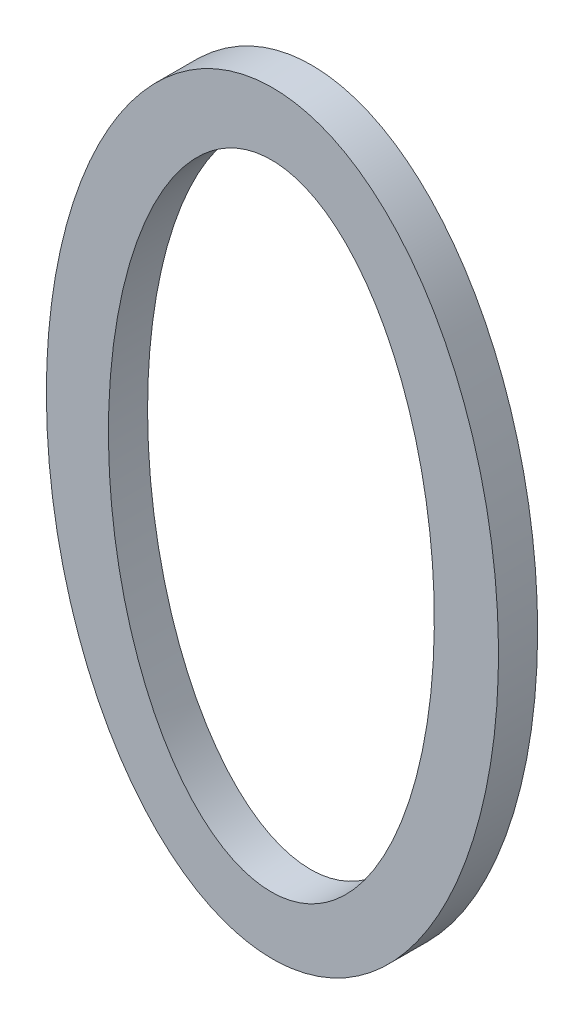
ISO-10303-21;
HEADER;
FILE_DESCRIPTION(('STEP AP214'),'2;1');
FILE_NAME('part.step','',(''),(''),'','','');
FILE_SCHEMA(('AUTOMOTIVE_DESIGN { 1 0 10303 214 1 1 1 1 }'));
ENDSEC;
DATA;
#1=APPLICATION_CONTEXT('core data for automotive mechanical design processes');
#2=APPLICATION_PROTOCOL_DEFINITION('international standard','automotive_design',2000,#1);
#3=PRODUCT_CONTEXT('',#1,'mechanical');
#4=PRODUCT('Part','Part','',(#3));
#5=PRODUCT_RELATED_PRODUCT_CATEGORY('part','',(#4));
#6=PRODUCT_DEFINITION_FORMATION('','',#4);
#7=PRODUCT_DEFINITION_CONTEXT('part definition',#1,'design');
#8=PRODUCT_DEFINITION('design','',#6,#7);
#9=PRODUCT_DEFINITION_SHAPE('','',#8);
#10=(LENGTH_UNIT() NAMED_UNIT(*) SI_UNIT(.MILLI.,.METRE.));
#11=(NAMED_UNIT(*) PLANE_ANGLE_UNIT() SI_UNIT($,.RADIAN.));
#12=(NAMED_UNIT(*) SI_UNIT($,.STERADIAN.) SOLID_ANGLE_UNIT());
#13=UNCERTAINTY_MEASURE_WITH_UNIT(LENGTH_MEASURE(1.E-05),#10,'distance_accuracy_value','');
#14=(GEOMETRIC_REPRESENTATION_CONTEXT(3) GLOBAL_UNCERTAINTY_ASSIGNED_CONTEXT((#13)) GLOBAL_UNIT_ASSIGNED_CONTEXT((#10,
#11,#12)) REPRESENTATION_CONTEXT('',''));
#15=CARTESIAN_POINT('',(0.,0.,0.));
#16=DIRECTION('',(0.,0.,1.));
#17=DIRECTION('',(1.,0.,0.));
#18=AXIS2_PLACEMENT_3D('',#15,#16,#17);
#19=CARTESIAN_POINT('',(-0.239741070500927,-0.0928215205563488,-0.000499999999999999));
#20=CARTESIAN_POINT('',(-0.23557745361825,-0.0928215205563488,-0.000499999999999999));
#21=CARTESIAN_POINT('',(-0.23557745361825,-0.0847200926686513,-0.000499999999999999));
#22=CARTESIAN_POINT('',(-0.23557745361825,-0.0766186647809537,-0.000499999999999999));
#23=CARTESIAN_POINT('',(-0.239741070500927,-0.0766186647809537,-0.000499999999999999));
#24=CARTESIAN_POINT('',(-0.243904687383605,-0.0766186647809537,-0.000499999999999999));
#25=CARTESIAN_POINT('',(-0.243904687383605,-0.0847200926686513,-0.000499999999999999));
#26=CARTESIAN_POINT('',(-0.243904687383605,-0.0928215205563488,-0.000499999999999999));
#27=CARTESIAN_POINT('',(-0.239741070500927,-0.0928215205563488,-0.000499999999999999));
#28=CARTESIAN_POINT('',(-0.239741070500927,-0.0928215205563488,0.000499999999999999));
#29=CARTESIAN_POINT('',(-0.23557745361825,-0.0928215205563488,0.000499999999999999));
#30=CARTESIAN_POINT('',(-0.23557745361825,-0.0847200926686513,0.000499999999999999));
#31=CARTESIAN_POINT('',(-0.23557745361825,-0.0766186647809537,0.000499999999999999));
#32=CARTESIAN_POINT('',(-0.239741070500927,-0.0766186647809537,0.000499999999999999));
#33=CARTESIAN_POINT('',(-0.243904687383605,-0.0766186647809537,0.000499999999999999));
#34=CARTESIAN_POINT('',(-0.243904687383605,-0.0847200926686513,0.000499999999999999));
#35=CARTESIAN_POINT('',(-0.243904687383605,-0.0928215205563488,0.000499999999999999));
#36=CARTESIAN_POINT('',(-0.239741070500927,-0.0928215205563488,0.000499999999999999));
#37=(BOUNDED_SURFACE() B_SPLINE_SURFACE(1,2,((#19,#20,#21,#22,#23,#24,#25,#26,#27),(#28,#29,#30,
#31,#32,#33,#34,#35,#36)),.UNSPECIFIED.,.F.,.T.,.F.) B_SPLINE_SURFACE_WITH_KNOTS((2,2),(3,2,2,2,
3),(-0.123435030696077,0.),(-3.14159265358979,-1.5707963267949,0.,1.5707963267949,
3.14159265358979),.UNSPECIFIED.) GEOMETRIC_REPRESENTATION_ITEM() RATIONAL_B_SPLINE_SURFACE(((1.,
0.707106781186548,1.,0.707106781186548,1.,0.707106781186548,1.,0.707106781186548,1.),(1.,
0.707106781186548,1.,0.707106781186548,1.,0.707106781186548,1.,0.707106781186548,1.))) REPRESENTATION_ITEM('') SURFACE());
#38=CARTESIAN_POINT('',(-0.239741070500927,-0.0928215205563488,-0.000499999999999999));
#39=CARTESIAN_POINT('',(-0.243904687383605,-0.0928215205563488,-0.000499999999999999));
#40=CARTESIAN_POINT('',(-0.243904687383605,-0.0847200926686513,-0.000499999999999999));
#41=CARTESIAN_POINT('',(-0.243904687383605,-0.0766186647809537,-0.000499999999999999));
#42=CARTESIAN_POINT('',(-0.239741070500927,-0.0766186647809537,-0.000499999999999999));
#43=CARTESIAN_POINT('',(-0.23557745361825,-0.0766186647809537,-0.000499999999999999));
#44=CARTESIAN_POINT('',(-0.23557745361825,-0.0847200926686513,-0.000499999999999999));
#45=CARTESIAN_POINT('',(-0.23557745361825,-0.0928215205563488,-0.000499999999999999));
#46=CARTESIAN_POINT('',(-0.239741070500927,-0.0928215205563488,-0.000499999999999999));
#47=(BOUNDED_CURVE() B_SPLINE_CURVE(2,(#38,#39,#40,#41,#42,#43,#44,#45,#46),.UNSPECIFIED.,.T.,
.F.) B_SPLINE_CURVE_WITH_KNOTS((3,2,2,2,3),(-3.14159265358979,-1.5707963267949,0.,
1.5707963267949,3.14159265358979),
.UNSPECIFIED.) CURVE() GEOMETRIC_REPRESENTATION_ITEM() RATIONAL_B_SPLINE_CURVE((1.,
0.707106781186548,1.,0.707106781186548,1.,0.707106781186548,1.,0.707106781186548,1.)) REPRESENTATION_ITEM(''));
#48=CARTESIAN_POINT('',(-0.239741070500927,-0.0928215205563488,-0.000499999999999999));
#49=VERTEX_POINT('',#48);
#50=EDGE_CURVE('E11',#49,#49,#47,.F.);
#51=CARTESIAN_POINT('',(-0.239741070500927,-0.0928215205563488,-0.000499999999999999));
#52=CARTESIAN_POINT('',(-0.239741070500927,-0.0928215205563488,0.000499999999999999));
#53=B_SPLINE_CURVE_WITH_KNOTS('',1,(#51,#52),.UNSPECIFIED.,.F.,.F.,(2,2),(-0.123435030696077,
0.),.UNSPECIFIED.);
#54=CARTESIAN_POINT('',(-0.239741070500927,-0.0928215205563488,0.000499999999999999));
#55=VERTEX_POINT('',#54);
#56=EDGE_CURVE('E27',#49,#55,#53,.T.);
#57=CARTESIAN_POINT('',(-0.239741070500927,-0.0928215205563488,0.000499999999999999));
#58=CARTESIAN_POINT('',(-0.239710255624817,-0.0928215219779034,0.000499999999999999));
#59=CARTESIAN_POINT('',(-0.239679441054796,-0.0928208549871667,0.000499999999999999));
#60=CARTESIAN_POINT('',(-0.239617549606014,-0.0928181805777694,0.000499999999999999));
#61=CARTESIAN_POINT('',(-0.239586473324224,-0.0928161593186057,0.000499999999999999));
#62=CARTESIAN_POINT('',(-0.239524078410907,-0.0928107418398933,0.000499999999999999));
#63=CARTESIAN_POINT('',(-0.239492761139654,-0.0928073299708319,0.000499999999999999));
#64=CARTESIAN_POINT('',(-0.239429904919492,-0.0927991001030989,0.000499999999999999));
#65=CARTESIAN_POINT('',(-0.239398368253061,-0.0927942646901675,0.000499999999999999));
#66=CARTESIAN_POINT('',(-0.239335094974164,-0.0927831573493299,0.000499999999999999));
#67=CARTESIAN_POINT('',(-0.239303361722461,-0.092776866298359,0.000499999999999999));
#68=CARTESIAN_POINT('',(-0.239239717955471,-0.0927628189271733,0.000499999999999999));
#69=CARTESIAN_POINT('',(-0.23920781202009,-0.0927550418814285,0.000499999999999999));
#70=CARTESIAN_POINT('',(-0.23914384653551,-0.0927379953143086,0.000499999999999999));
#71=CARTESIAN_POINT('',(-0.239111792905908,-0.0927287036069431,0.000499999999999999));
#72=CARTESIAN_POINT('',(-0.239047556632652,-0.0927086022326721,0.000499999999999999));
#73=CARTESIAN_POINT('',(-0.239015381342398,-0.0926977690957382,0.000499999999999999));
#74=CARTESIAN_POINT('',(-0.238950927288394,-0.0926745612102115,0.000499999999999999));
#75=CARTESIAN_POINT('',(-0.238918657375391,-0.092662161910983,0.000499999999999999));
#76=CARTESIAN_POINT('',(-0.238854040542747,-0.092635800013457,0.000499999999999999));
#77=CARTESIAN_POINT('',(-0.238821704001541,-0.092621812007243,0.000499999999999999));
#78=CARTESIAN_POINT('',(-0.238756981287364,-0.0925922531050914,0.000499999999999999));
#79=CARTESIAN_POINT('',(-0.238724607016808,-0.0925766561791553,0.000499999999999999));
#80=CARTESIAN_POINT('',(-0.238659837102138,-0.0925438620806571,0.000499999999999999));
#81=CARTESIAN_POINT('',(-0.238627454847485,-0.0925266384952147,0.000499999999999999));
#82=CARTESIAN_POINT('',(-0.238562698073738,-0.0924905760932693,0.000499999999999999));
#83=CARTESIAN_POINT('',(-0.238530338363299,-0.0924717107168161,0.000499999999999999));
#84=CARTESIAN_POINT('',(-0.238465656596576,-0.09243235226001,0.000499999999999999));
#85=CARTESIAN_POINT('',(-0.238433350672856,-0.0924118326985725,0.000499999999999999));
#86=CARTESIAN_POINT('',(-0.238368807156111,-0.0923691560475774,0.000499999999999999));
#87=CARTESIAN_POINT('',(-0.238336586901167,-0.0923469727665091,0.000499999999999999));
#88=CARTESIAN_POINT('',(-0.238272246095173,-0.0923009616339073,0.000499999999999999));
#89=CARTESIAN_POINT('',(-0.23824014395103,-0.0922771080718518,0.000499999999999999));
#90=CARTESIAN_POINT('',(-0.238176071362256,-0.0922277522411537,0.000499999999999999));
#91=CARTESIAN_POINT('',(-0.238144120243262,-0.0922022249122562,0.000499999999999999));
#92=CARTESIAN_POINT('',(-0.238080382248081,-0.0921495204413501,0.000499999999999999));
#93=CARTESIAN_POINT('',(-0.238048615457796,-0.0921223190350897,0.000499999999999999));
#94=CARTESIAN_POINT('',(-0.237985279089599,-0.09206626841285,0.000499999999999999));
#95=CARTESIAN_POINT('',(-0.237953730194634,-0.092037395849571,0.000499999999999999));
#96=CARTESIAN_POINT('',(-0.237890863026434,-0.0919780082156455,0.000499999999999999));
#97=CARTESIAN_POINT('',(-0.237859565872452,-0.0919474708139435,0.000499999999999999));
#98=CARTESIAN_POINT('',(-0.237797235487511,-0.0918847618069917,0.000499999999999999));
#99=CARTESIAN_POINT('',(-0.237766223644756,-0.0918525689550075,0.000499999999999999));
#100=CARTESIAN_POINT('',(-0.237704498658365,-0.0917865618573618,0.000499999999999999));
#101=CARTESIAN_POINT('',(-0.237673807048328,-0.0917527275282628,0.000499999999999999));
#102=CARTESIAN_POINT('',(-0.237581251269773,-0.0916477056543155,0.000499999999999999));
#103=CARTESIAN_POINT('',(-0.237520987160101,-0.0915751001337143,0.000499999999999999));
#104=CARTESIAN_POINT('',(-0.237401975965692,-0.0914237060321999,0.000499999999999999));
#105=CARTESIAN_POINT('',(-0.237343397350655,-0.0913447858628405,0.000499999999999999));
#106=CARTESIAN_POINT('',(-0.237228015533471,-0.0911809645291218,0.000499999999999999));
#107=CARTESIAN_POINT('',(-0.237171373370647,-0.0910959502318112,0.000499999999999999));
#108=CARTESIAN_POINT('',(-0.237060121615343,-0.090920204657932,0.000499999999999999));
#109=CARTESIAN_POINT('',(-0.237005663081152,-0.0908293780877442,0.000499999999999999));
#110=CARTESIAN_POINT('',(-0.236899021302058,-0.0906423204665298,0.000499999999999999));
#111=CARTESIAN_POINT('',(-0.236846976929139,-0.0905460104774371,0.000499999999999999));
#112=CARTESIAN_POINT('',(-0.236745390377323,-0.0903483465773976,0.000499999999999999));
#113=CARTESIAN_POINT('',(-0.236695973426184,-0.0902469284925661,0.000499999999999999));
#114=CARTESIAN_POINT('',(-0.236599848562429,-0.0900394514248187,0.000499999999999999));
#115=CARTESIAN_POINT('',(-0.236553251310576,-0.0899333413104373,0.000499999999999999));
#116=CARTESIAN_POINT('',(-0.236462949818907,-0.0897169202861266,0.000499999999999999));
#117=CARTESIAN_POINT('',(-0.236419341226868,-0.0896065695693265,0.000499999999999999));
#118=CARTESIAN_POINT('',(-0.236335175678132,-0.089382138107317,0.000499999999999999));
#119=CARTESIAN_POINT('',(-0.236294699292596,-0.08926802722033,0.000499999999999999));
#120=CARTESIAN_POINT('',(-0.236216929573575,-0.0890365698632435,0.000499999999999999));
#121=CARTESIAN_POINT('',(-0.236179701975977,-0.088919201355896,0.000499999999999999));
#122=CARTESIAN_POINT('',(-0.236108533075528,-0.088681740090854,0.000499999999999999));
#123=CARTESIAN_POINT('',(-0.236074643155416,-0.0885616319706723,0.000499999999999999));
#124=CARTESIAN_POINT('',(-0.236010223317749,-0.0883192108050715,0.000499999999999999));
#125=CARTESIAN_POINT('',(-0.235979731081215,-0.088196887758484,0.000499999999999999));
#126=CARTESIAN_POINT('',(-0.235922153967183,-0.0879505629573102,0.000499999999999999));
#127=CARTESIAN_POINT('',(-0.23589509387889,-0.0878265554432664,0.000499999999999999));
#128=CARTESIAN_POINT('',(-0.23581898607276,-0.0874525072869222,0.000499999999999999));
#129=CARTESIAN_POINT('',(-0.23577525471483,-0.0872013681411857,0.000499999999999999));
#130=CARTESIAN_POINT('',(-0.235701278327137,-0.0866984299777538,0.000499999999999999));
#131=CARTESIAN_POINT('',(-0.235670966782733,-0.0864466405807865,0.000499999999999999));
#132=CARTESIAN_POINT('',(-0.235623353048416,-0.0859459928462514,0.000499999999999999));
#133=CARTESIAN_POINT('',(-0.235605846236532,-0.0856971539045329,0.000499999999999999));
#134=CARTESIAN_POINT('',(-0.235583053048223,-0.0852055646310518,0.000499999999999999));
#135=CARTESIAN_POINT('',(-0.23557745361825,-0.0849628286498513,0.000499999999999999));
#136=CARTESIAN_POINT('',(-0.23557745361825,-0.0844773566874504,0.000499999999999999));
#137=CARTESIAN_POINT('',(-0.235583053048223,-0.08423462070625,0.000499999999999999));
#138=CARTESIAN_POINT('',(-0.235605846236532,-0.0837430314327689,0.000499999999999999));
#139=CARTESIAN_POINT('',(-0.235623353048416,-0.0834941924910504,0.000499999999999999));
#140=CARTESIAN_POINT('',(-0.235670966782733,-0.0829935447565153,0.000499999999999999));
#141=CARTESIAN_POINT('',(-0.235701278327138,-0.082741755359548,0.000499999999999999));
#142=CARTESIAN_POINT('',(-0.23577525471483,-0.0822388171961161,0.000499999999999999));
#143=CARTESIAN_POINT('',(-0.23581898607276,-0.0819876780503796,0.000499999999999999));
#144=CARTESIAN_POINT('',(-0.235895093878891,-0.0816136298940354,0.000499999999999999));
#145=CARTESIAN_POINT('',(-0.235922153967183,-0.0814896223799916,0.000499999999999999));
#146=CARTESIAN_POINT('',(-0.235979731081215,-0.0812432975788178,0.000499999999999999));
#147=CARTESIAN_POINT('',(-0.236010223317749,-0.0811209745322303,0.000499999999999999));
#148=CARTESIAN_POINT('',(-0.236074643155416,-0.0808785533666295,0.000499999999999999));
#149=CARTESIAN_POINT('',(-0.236108533075528,-0.0807584452464479,0.000499999999999999));
#150=CARTESIAN_POINT('',(-0.236179701975977,-0.0805209839814059,0.000499999999999999));
#151=CARTESIAN_POINT('',(-0.236216929573575,-0.0804036154740584,0.000499999999999999));
#152=CARTESIAN_POINT('',(-0.236294699292597,-0.0801721581169718,0.000499999999999999));
#153=CARTESIAN_POINT('',(-0.236335175678133,-0.0800580472299849,0.000499999999999999));
#154=CARTESIAN_POINT('',(-0.236419341226868,-0.0798336157679753,0.000499999999999999));
#155=CARTESIAN_POINT('',(-0.236462949818908,-0.0797232650511753,0.000499999999999999));
#156=CARTESIAN_POINT('',(-0.236553251310576,-0.0795068440268646,0.000499999999999999));
#157=CARTESIAN_POINT('',(-0.23659984856243,-0.0794007339124833,0.000499999999999999));
#158=CARTESIAN_POINT('',(-0.236695973426185,-0.0791932568447359,0.000499999999999999));
#159=CARTESIAN_POINT('',(-0.236745390377324,-0.0790918387599044,0.000499999999999999));
#160=CARTESIAN_POINT('',(-0.23684697692914,-0.0788941748598649,0.000499999999999999));
#161=CARTESIAN_POINT('',(-0.236899021302058,-0.0787978648707723,0.000499999999999999));
#162=CARTESIAN_POINT('',(-0.237005663081152,-0.0786108072495579,0.000499999999999999));
#163=CARTESIAN_POINT('',(-0.237060121615344,-0.07851998067937,0.000499999999999999));
#164=CARTESIAN_POINT('',(-0.237171373370647,-0.0783442351054909,0.000499999999999999));
#165=CARTESIAN_POINT('',(-0.237228015533472,-0.0782592208081802,0.000499999999999999));
#166=CARTESIAN_POINT('',(-0.237343397350655,-0.0780953994744616,0.000499999999999999));
#167=CARTESIAN_POINT('',(-0.237401975965692,-0.0780164793051022,0.000499999999999999));
#168=CARTESIAN_POINT('',(-0.237520987160101,-0.0778650852035879,0.000499999999999999));
#169=CARTESIAN_POINT('',(-0.237581251269773,-0.0777924796829867,0.000499999999999999));
#170=CARTESIAN_POINT('',(-0.237673807048328,-0.0776874578090394,0.000499999999999999));
#171=CARTESIAN_POINT('',(-0.237704498658366,-0.0776536234799405,0.000499999999999999));
#172=CARTESIAN_POINT('',(-0.237766223644757,-0.0775876163822947,0.000499999999999999));
#173=CARTESIAN_POINT('',(-0.237797235487512,-0.0775554235303105,0.000499999999999999));
#174=CARTESIAN_POINT('',(-0.237859565872452,-0.0774927145233587,0.000499999999999999));
#175=CARTESIAN_POINT('',(-0.237890863026434,-0.0774621771216568,0.000499999999999999));
#176=CARTESIAN_POINT('',(-0.237953730194635,-0.0774027894877313,0.000499999999999999));
#177=CARTESIAN_POINT('',(-0.237985279089599,-0.0773739169244523,0.000499999999999999));
#178=CARTESIAN_POINT('',(-0.238048615457797,-0.0773178663022126,0.000499999999999999));
#179=CARTESIAN_POINT('',(-0.238080382248082,-0.0772906648959522,0.000499999999999999));
#180=CARTESIAN_POINT('',(-0.238144120243262,-0.0772379604250461,0.000499999999999999));
#181=CARTESIAN_POINT('',(-0.238176071362256,-0.0772124330961485,0.000499999999999999));
#182=CARTESIAN_POINT('',(-0.238240143951031,-0.0771630772654504,0.000499999999999999));
#183=CARTESIAN_POINT('',(-0.238272246095174,-0.077139223703395,0.000499999999999999));
#184=CARTESIAN_POINT('',(-0.238336586901168,-0.0770932125707932,0.000499999999999999));
#185=CARTESIAN_POINT('',(-0.238368807156112,-0.0770710292897249,0.000499999999999999));
#186=CARTESIAN_POINT('',(-0.238433350672856,-0.0770283526387298,0.000499999999999999));
#187=CARTESIAN_POINT('',(-0.238465656596576,-0.0770078330772923,0.000499999999999999));
#188=CARTESIAN_POINT('',(-0.2385303383633,-0.0769684746204863,0.000499999999999999));
#189=CARTESIAN_POINT('',(-0.238562698073739,-0.0769496092440334,0.000499999999999999));
#190=CARTESIAN_POINT('',(-0.238627454847485,-0.0769135468420874,0.000499999999999999));
#191=CARTESIAN_POINT('',(-0.238659837102138,-0.0768963232566444,0.000499999999999999));
#192=CARTESIAN_POINT('',(-0.238724607016809,-0.076863529158148,0.000499999999999999));
#193=CARTESIAN_POINT('',(-0.238756981287365,-0.0768479322322144,0.000499999999999999));
#194=CARTESIAN_POINT('',(-0.238821704001541,-0.0768183733300561,0.000499999999999999));
#195=CARTESIAN_POINT('',(-0.238854040542746,-0.076804385323833,0.000499999999999999));
#196=CARTESIAN_POINT('',(-0.238918657375393,-0.0767780234263315,0.000499999999999999));
#197=CARTESIAN_POINT('',(-0.238950927288399,-0.0767656241271358,0.000499999999999999));
#198=CARTESIAN_POINT('',(-0.239015381342393,-0.0767424162415201,0.000499999999999999));
#199=CARTESIAN_POINT('',(-0.239047556632633,-0.0767315831044674,0.000499999999999999));
#200=CARTESIAN_POINT('',(-0.239111792905928,-0.0767114817305196,0.000499999999999999));
#201=CARTESIAN_POINT('',(-0.239143846535584,-0.0767021900235867,0.000499999999999999));
#202=CARTESIAN_POINT('',(-0.239207812020018,-0.0766851434552907,0.000499999999999999));
#203=CARTESIAN_POINT('',(-0.239239717955203,-0.0766773664079695,0.000499999999999999));
#204=CARTESIAN_POINT('',(-0.239303361722726,-0.076663319041071,0.000499999999999999));
#205=CARTESIAN_POINT('',(-0.239335094975145,-0.0766570279958531,0.000499999999999999));
#206=CARTESIAN_POINT('',(-0.239398368252095,-0.0766459206393631,0.000499999999999999));
#207=CARTESIAN_POINT('',(-0.239429904915909,-0.0766410852053995,0.000499999999999999));
#208=CARTESIAN_POINT('',(-0.239492761143192,-0.0766328553949113,0.000499999999999999));
#209=CARTESIAN_POINT('',(-0.239524078424029,-0.0766294436028769,0.000499999999999999));
#210=CARTESIAN_POINT('',(-0.239586473311253,-0.0766240259144365,0.000499999999999999));
#211=CARTESIAN_POINT('',(-0.239617549557883,-0.0766220043726715,0.000499999999999999));
#212=CARTESIAN_POINT('',(-0.239679441102433,-0.0766193307330235,0.000499999999999999));
#213=CARTESIAN_POINT('',(-0.23971025580168,-0.0766186647809538,0.000499999999999999));
#214=CARTESIAN_POINT('',(-0.239771885200175,-0.0766186647809538,0.000499999999999999));
#215=CARTESIAN_POINT('',(-0.239802699899422,-0.0766193307330235,0.000499999999999999));
#216=CARTESIAN_POINT('',(-0.239864591443972,-0.0766220043726715,0.000499999999999999));
#217=CARTESIAN_POINT('',(-0.239895667690602,-0.0766240259144365,0.000499999999999999));
#218=CARTESIAN_POINT('',(-0.239958062577826,-0.0766294436028769,0.000499999999999999));
#219=CARTESIAN_POINT('',(-0.239989379858663,-0.0766328553949113,0.000499999999999999));
#220=CARTESIAN_POINT('',(-0.240052236085946,-0.0766410852053996,0.000499999999999999));
#221=CARTESIAN_POINT('',(-0.240083772749761,-0.0766459206393632,0.000499999999999999));
#222=CARTESIAN_POINT('',(-0.240147046026711,-0.0766570279958532,0.000499999999999999));
#223=CARTESIAN_POINT('',(-0.240178779279129,-0.0766633190410711,0.000499999999999999));
#224=CARTESIAN_POINT('',(-0.240242423046652,-0.0766773664079696,0.000499999999999999));
#225=CARTESIAN_POINT('',(-0.240274328981837,-0.0766851434552907,0.000499999999999999));
#226=CARTESIAN_POINT('',(-0.240338294466272,-0.0767021900235868,0.000499999999999999));
#227=CARTESIAN_POINT('',(-0.240370348095927,-0.0767114817305197,0.000499999999999999));
#228=CARTESIAN_POINT('',(-0.240434584369223,-0.0767315831044675,0.000499999999999999));
#229=CARTESIAN_POINT('',(-0.240466759659463,-0.0767424162415202,0.000499999999999999));
#230=CARTESIAN_POINT('',(-0.240531213713456,-0.076765624127136,0.000499999999999999));
#231=CARTESIAN_POINT('',(-0.240563483626463,-0.0767780234263317,0.000499999999999999));
#232=CARTESIAN_POINT('',(-0.24062810045911,-0.0768043853238332,0.000499999999999999));
#233=CARTESIAN_POINT('',(-0.240660437000314,-0.0768183733300563,0.000499999999999999));
#234=CARTESIAN_POINT('',(-0.240725159714491,-0.0768479322322146,0.000499999999999999));
#235=CARTESIAN_POINT('',(-0.240757533985047,-0.0768635291581482,0.000499999999999999));
#236=CARTESIAN_POINT('',(-0.240822303899717,-0.0768963232566446,0.000499999999999999));
#237=CARTESIAN_POINT('',(-0.24085468615437,-0.0769135468420876,0.000499999999999999));
#238=CARTESIAN_POINT('',(-0.240919442928117,-0.0769496092440336,0.000499999999999999));
#239=CARTESIAN_POINT('',(-0.240951802638555,-0.0769684746204866,0.000499999999999999));
#240=CARTESIAN_POINT('',(-0.241016484405279,-0.0770078330772926,0.000499999999999999));
#241=CARTESIAN_POINT('',(-0.241048790328999,-0.0770283526387301,0.000499999999999999));
#242=CARTESIAN_POINT('',(-0.241113333845744,-0.0770710292897252,0.000499999999999999));
#243=CARTESIAN_POINT('',(-0.241145554100688,-0.0770932125707934,0.000499999999999999));
#244=CARTESIAN_POINT('',(-0.241209894906682,-0.0771392237033953,0.000499999999999999));
#245=CARTESIAN_POINT('',(-0.241241997050825,-0.0771630772654507,0.000499999999999999));
#246=CARTESIAN_POINT('',(-0.241306069639599,-0.0772124330961488,0.000499999999999999));
#247=CARTESIAN_POINT('',(-0.241338020758593,-0.0772379604250464,0.000499999999999999));
#248=CARTESIAN_POINT('',(-0.241401758753773,-0.0772906648959525,0.000499999999999999));
#249=CARTESIAN_POINT('',(-0.241433525544058,-0.0773178663022129,0.000499999999999999));
#250=CARTESIAN_POINT('',(-0.241496861912256,-0.0773739169244526,0.000499999999999999));
#251=CARTESIAN_POINT('',(-0.241528410807221,-0.0774027894877316,0.000499999999999999));
#252=CARTESIAN_POINT('',(-0.241591277975421,-0.0774621771216571,0.000499999999999999));
#253=CARTESIAN_POINT('',(-0.241622575129403,-0.0774927145233591,0.000499999999999999));
#254=CARTESIAN_POINT('',(-0.241684905514344,-0.0775554235303109,0.000499999999999999));
#255=CARTESIAN_POINT('',(-0.241715917357099,-0.0775876163822951,0.000499999999999999));
#256=CARTESIAN_POINT('',(-0.241777642343489,-0.0776536234799408,0.000499999999999999));
#257=CARTESIAN_POINT('',(-0.241808333953527,-0.0776874578090398,0.000499999999999999));
#258=CARTESIAN_POINT('',(-0.241900889732082,-0.0777924796829871,0.000499999999999999));
#259=CARTESIAN_POINT('',(-0.241961153841754,-0.0778650852035883,0.000499999999999999));
#260=CARTESIAN_POINT('',(-0.242080165036163,-0.0780164793051027,0.000499999999999999));
#261=CARTESIAN_POINT('',(-0.2421387436512,-0.078095399474462,0.000499999999999999));
#262=CARTESIAN_POINT('',(-0.242254125468383,-0.0782592208081807,0.000499999999999999));
#263=CARTESIAN_POINT('',(-0.242310767631208,-0.0783442351054914,0.000499999999999999));
#264=CARTESIAN_POINT('',(-0.242422019386512,-0.0785199806793705,0.000499999999999999));
#265=CARTESIAN_POINT('',(-0.242476477920703,-0.0786108072495584,0.000499999999999999));
#266=CARTESIAN_POINT('',(-0.242583119699797,-0.0787978648707728,0.000499999999999999));
#267=CARTESIAN_POINT('',(-0.242635164072716,-0.0788941748598655,0.000499999999999999));
#268=CARTESIAN_POINT('',(-0.242736750624532,-0.079091838759905,0.000499999999999999));
#269=CARTESIAN_POINT('',(-0.242786167575671,-0.0791932568447365,0.000499999999999999));
#270=CARTESIAN_POINT('',(-0.242882292439426,-0.0794007339124839,0.000499999999999999));
#271=CARTESIAN_POINT('',(-0.242928889691279,-0.0795068440268652,0.000499999999999999));
#272=CARTESIAN_POINT('',(-0.243019191182948,-0.0797232650511759,0.000499999999999999));
#273=CARTESIAN_POINT('',(-0.243062799774987,-0.079833615767976,0.000499999999999999));
#274=CARTESIAN_POINT('',(-0.243146965323723,-0.0800580472299856,0.000499999999999999));
#275=CARTESIAN_POINT('',(-0.243187441709259,-0.0801721581169725,0.000499999999999999));
#276=CARTESIAN_POINT('',(-0.24326521142828,-0.0804036154740591,0.000499999999999999));
#277=CARTESIAN_POINT('',(-0.243302439025878,-0.0805209839814065,0.000499999999999999));
#278=CARTESIAN_POINT('',(-0.243373607926327,-0.0807584452464486,0.000499999999999999));
#279=CARTESIAN_POINT('',(-0.243407497846439,-0.0808785533666302,0.000499999999999999));
#280=CARTESIAN_POINT('',(-0.243471917684106,-0.081120974532231,0.000499999999999999));
#281=CARTESIAN_POINT('',(-0.24350240992064,-0.0812432975788185,0.000499999999999999));
#282=CARTESIAN_POINT('',(-0.243559987034672,-0.0814896223799923,0.000499999999999999));
#283=CARTESIAN_POINT('',(-0.243587047122965,-0.0816136298940361,0.000499999999999999));
#284=CARTESIAN_POINT('',(-0.243663154929095,-0.0819876780503804,0.000499999999999999));
#285=CARTESIAN_POINT('',(-0.243706886287025,-0.0822388171961168,0.000499999999999999));
#286=CARTESIAN_POINT('',(-0.243780862674717,-0.0827417553595488,0.000499999999999999));
#287=CARTESIAN_POINT('',(-0.243811174219122,-0.082993544756516,0.000499999999999999));
#288=CARTESIAN_POINT('',(-0.243858787953439,-0.0834941924910511,0.000499999999999999));
#289=CARTESIAN_POINT('',(-0.243876294765323,-0.0837430314327696,0.000499999999999999));
#290=CARTESIAN_POINT('',(-0.243899087953632,-0.0842346207062507,0.000499999999999999));
#291=CARTESIAN_POINT('',(-0.243904687383605,-0.0844773566874512,0.000499999999999999));
#292=CARTESIAN_POINT('',(-0.243904687383605,-0.0849628286498521,0.000499999999999999));
#293=CARTESIAN_POINT('',(-0.243899087953632,-0.0852055646310525,0.000499999999999999));
#294=CARTESIAN_POINT('',(-0.243876294765323,-0.0856971539045336,0.000499999999999999));
#295=CARTESIAN_POINT('',(-0.243858787953439,-0.0859459928462521,0.000499999999999999));
#296=CARTESIAN_POINT('',(-0.243811174219122,-0.0864466405807872,0.000499999999999999));
#297=CARTESIAN_POINT('',(-0.243780862674717,-0.0866984299777545,0.000499999999999999));
#298=CARTESIAN_POINT('',(-0.243706886287025,-0.0872013681411864,0.000499999999999999));
#299=CARTESIAN_POINT('',(-0.243663154929095,-0.0874525072869229,0.000499999999999999));
#300=CARTESIAN_POINT('',(-0.243587047122964,-0.0878265554432671,0.000499999999999999));
#301=CARTESIAN_POINT('',(-0.243559987034672,-0.0879505629573109,0.000499999999999999));
#302=CARTESIAN_POINT('',(-0.24350240992064,-0.0881968877584847,0.000499999999999999));
#303=CARTESIAN_POINT('',(-0.243471917684106,-0.0883192108050723,0.000499999999999999));
#304=CARTESIAN_POINT('',(-0.243407497846439,-0.088561631970673,0.000499999999999999));
#305=CARTESIAN_POINT('',(-0.243373607926327,-0.0886817400908547,0.000499999999999999));
#306=CARTESIAN_POINT('',(-0.243302439025878,-0.0889192013558967,0.000499999999999999));
#307=CARTESIAN_POINT('',(-0.243265211428279,-0.0890365698632441,0.000499999999999999));
#308=CARTESIAN_POINT('',(-0.243187441709258,-0.0892680272203307,0.000499999999999999));
#309=CARTESIAN_POINT('',(-0.243146965323722,-0.0893821381073176,0.000499999999999999));
#310=CARTESIAN_POINT('',(-0.243062799774987,-0.0896065695693272,0.000499999999999999));
#311=CARTESIAN_POINT('',(-0.243019191182947,-0.0897169202861272,0.000499999999999999));
#312=CARTESIAN_POINT('',(-0.242928889691279,-0.0899333413104379,0.000499999999999999));
#313=CARTESIAN_POINT('',(-0.242882292439425,-0.0900394514248193,0.000499999999999999));
#314=CARTESIAN_POINT('',(-0.24278616757567,-0.0902469284925667,0.000499999999999999));
#315=CARTESIAN_POINT('',(-0.242736750624531,-0.0903483465773981,0.000499999999999999));
#316=CARTESIAN_POINT('',(-0.242635164072715,-0.0905460104774376,0.000499999999999999));
#317=CARTESIAN_POINT('',(-0.242583119699797,-0.0906423204665303,0.000499999999999999));
#318=CARTESIAN_POINT('',(-0.242476477920703,-0.0908293780877447,0.000499999999999999));
#319=CARTESIAN_POINT('',(-0.242422019386511,-0.0909202046579325,0.000499999999999999));
#320=CARTESIAN_POINT('',(-0.242310767631208,-0.0910959502318117,0.000499999999999999));
#321=CARTESIAN_POINT('',(-0.242254125468383,-0.0911809645291224,0.000499999999999999));
#322=CARTESIAN_POINT('',(-0.2421387436512,-0.091344785862841,0.000499999999999999));
#323=CARTESIAN_POINT('',(-0.242080165036163,-0.0914237060322003,0.000499999999999999));
#324=CARTESIAN_POINT('',(-0.241961153841754,-0.0915751001337147,0.000499999999999999));
#325=CARTESIAN_POINT('',(-0.241900889732081,-0.0916477056543159,0.000499999999999999));
#326=CARTESIAN_POINT('',(-0.241808333953526,-0.0917527275282632,0.000499999999999999));
#327=CARTESIAN_POINT('',(-0.241777642343489,-0.0917865618573622,0.000499999999999999));
#328=CARTESIAN_POINT('',(-0.241715917357098,-0.0918525689550079,0.000499999999999999));
#329=CARTESIAN_POINT('',(-0.241684905514343,-0.0918847618069921,0.000499999999999999));
#330=CARTESIAN_POINT('',(-0.241622575129403,-0.0919474708139439,0.000499999999999999));
#331=CARTESIAN_POINT('',(-0.241591277975421,-0.0919780082156458,0.000499999999999999));
#332=CARTESIAN_POINT('',(-0.24152841080722,-0.0920373958495713,0.000499999999999999));
#333=CARTESIAN_POINT('',(-0.241496861912256,-0.0920662684128503,0.000499999999999999));
#334=CARTESIAN_POINT('',(-0.241433525544058,-0.09212231903509,0.000499999999999999));
#335=CARTESIAN_POINT('',(-0.241401758753773,-0.0921495204413504,0.000499999999999999));
#336=CARTESIAN_POINT('',(-0.241338020758593,-0.0922022249122565,0.000499999999999999));
#337=CARTESIAN_POINT('',(-0.241306069639599,-0.0922277522411541,0.000499999999999999));
#338=CARTESIAN_POINT('',(-0.241241997050824,-0.0922771080718521,0.000499999999999999));
#339=CARTESIAN_POINT('',(-0.241209894906681,-0.0923009616339076,0.000499999999999999));
#340=CARTESIAN_POINT('',(-0.241145554100687,-0.0923469727665094,0.000499999999999999));
#341=CARTESIAN_POINT('',(-0.241113333845743,-0.0923691560475777,0.000499999999999999));
#342=CARTESIAN_POINT('',(-0.241048790328999,-0.0924118326985727,0.000499999999999999));
#343=CARTESIAN_POINT('',(-0.241016484405279,-0.0924323522600102,0.000499999999999999));
#344=CARTESIAN_POINT('',(-0.240951802638555,-0.0924717107168163,0.000499999999999999));
#345=CARTESIAN_POINT('',(-0.240919442928116,-0.0924905760932695,0.000499999999999999));
#346=CARTESIAN_POINT('',(-0.240854686154369,-0.0925266384952149,0.000499999999999999));
#347=CARTESIAN_POINT('',(-0.240822303899717,-0.0925438620806573,0.000499999999999999));
#348=CARTESIAN_POINT('',(-0.240757533985046,-0.0925766561791555,0.000499999999999999));
#349=CARTESIAN_POINT('',(-0.240725159714491,-0.0925922531050915,0.000499999999999999));
#350=CARTESIAN_POINT('',(-0.240660437000314,-0.0926218120072431,0.000499999999999999));
#351=CARTESIAN_POINT('',(-0.240628100459108,-0.0926358000134572,0.000499999999999999));
#352=CARTESIAN_POINT('',(-0.240563483626464,-0.0926621619109832,0.000499999999999999));
#353=CARTESIAN_POINT('',(-0.240531213713461,-0.0926745612102116,0.000499999999999999));
#354=CARTESIAN_POINT('',(-0.240466759659457,-0.0926977690957384,0.000499999999999999));
#355=CARTESIAN_POINT('',(-0.240434584369202,-0.0927086022326722,0.000499999999999999));
#356=CARTESIAN_POINT('',(-0.240370348095947,-0.0927287036069432,0.000499999999999999));
#357=CARTESIAN_POINT('',(-0.240338294466345,-0.0927379953143087,0.000499999999999999));
#358=CARTESIAN_POINT('',(-0.240274328981764,-0.0927550418814285,0.000499999999999999));
#359=CARTESIAN_POINT('',(-0.240242423046383,-0.0927628189271734,0.000499999999999999));
#360=CARTESIAN_POINT('',(-0.240178779279394,-0.0927768662983591,0.000499999999999999));
#361=CARTESIAN_POINT('',(-0.240147046027691,-0.09278315734933,0.000499999999999999));
#362=CARTESIAN_POINT('',(-0.240083772748794,-0.0927942646901676,0.000499999999999999));
#363=CARTESIAN_POINT('',(-0.240052236082362,-0.092799100103099,0.000499999999999999));
#364=CARTESIAN_POINT('',(-0.239989379862201,-0.0928073299708319,0.000499999999999999));
#365=CARTESIAN_POINT('',(-0.239958062590948,-0.0928107418398933,0.000499999999999999));
#366=CARTESIAN_POINT('',(-0.23989566767763,-0.0928161593186056,0.000499999999999999));
#367=CARTESIAN_POINT('',(-0.23986459139584,-0.0928181805777694,0.000499999999999999));
#368=CARTESIAN_POINT('',(-0.239802699947059,-0.0928208549871667,0.000499999999999999));
#369=CARTESIAN_POINT('',(-0.239771885377038,-0.0928215219779035,0.000499999999999999));
#370=CARTESIAN_POINT('',(-0.239741070500927,-0.0928215205563488,0.000499999999999999));
#371=B_SPLINE_CURVE_WITH_KNOTS('',3,(#57,#58,#59,#60,#61,#62,#63,#64,#65,#66,#67,#68,#69,#70,
#71,#72,#73,#74,#75,#76,#77,#78,#79,#80,#81,#82,#83,#84,#85,#86,#87,#88,#89,#90,#91,#92,#93,#94,
#95,#96,#97,#98,#99,#100,#101,#102,#103,#104,#105,#106,#107,#108,#109,#110,#111,#112,#113,#114,
#115,#116,#117,#118,#119,#120,#121,#122,#123,#124,#125,#126,#127,#128,#129,#130,#131,#132,#133,
#134,#135,#136,#137,#138,#139,#140,#141,#142,#143,#144,#145,#146,#147,#148,#149,#150,#151,#152,
#153,#154,#155,#156,#157,#158,#159,#160,#161,#162,#163,#164,#165,#166,#167,#168,#169,#170,#171,
#172,#173,#174,#175,#176,#177,#178,#179,#180,#181,#182,#183,#184,#185,#186,#187,#188,#189,#190,
#191,#192,#193,#194,#195,#196,#197,#198,#199,#200,#201,#202,#203,#204,#205,#206,#207,#208,#209,
#210,#211,#212,#213,#214,#215,#216,#217,#218,#219,#220,#221,#222,#223,#224,#225,#226,#227,#228,
#229,#230,#231,#232,#233,#234,#235,#236,#237,#238,#239,#240,#241,#242,#243,#244,#245,#246,#247,
#248,#249,#250,#251,#252,#253,#254,#255,#256,#257,#258,#259,#260,#261,#262,#263,#264,#265,#266,
#267,#268,#269,#270,#271,#272,#273,#274,#275,#276,#277,#278,#279,#280,#281,#282,#283,#284,#285,
#286,#287,#288,#289,#290,#291,#292,#293,#294,#295,#296,#297,#298,#299,#300,#301,#302,#303,#304,
#305,#306,#307,#308,#309,#310,#311,#312,#313,#314,#315,#316,#317,#318,#319,#320,#321,#322,#323,
#324,#325,#326,#327,#328,#329,#330,#331,#332,#333,#334,#335,#336,#337,#338,#339,#340,#341,#342,
#343,#344,#345,#346,#347,#348,#349,#350,#351,#352,#353,#354,#355,#356,#357,#358,#359,#360,#361,
#362,#363,#364,#365,#366,#367,#368,#369,#370),.UNSPECIFIED.,.F.,.F.,(4,2,2,2,2,2,2,2,2,2,2,2,2,
2,2,2,2,2,2,2,2,2,2,2,2,2,2,2,2,2,2,2,2,2,2,2,2,2,2,2,2,2,2,2,2,2,2,2,2,2,2,2,2,2,2,2,2,2,2,2,2,
2,2,2,2,2,2,2,2,2,2,2,2,2,2,2,2,2,2,2,2,2,2,2,2,2,2,2,2,2,2,2,2,2,2,2,2,2,2,2,2,2,2,2,2,2,2,2,2,
2,2,2,2,2,2,2,2,2,2,2,2,2,2,2,2,2,2,2,2,2,2,2,2,2,2,2,2,2,2,2,2,2,2,2,2,2,2,2,2,2,2,2,2,2,2,2,
4),(0.,9.24369557924251E-05,0.000185833318411763,0.000280311106502239,0.000375996405145386,
0.000473018326974037,0.000571507896299881,0.000671596879481113,0.00077341658593976,
0.000877096664155698,0.000982763915726889,0.00109054114837621,0.00120054608587019,
0.00131289034948772,0.0014276785222095,0.00154500730344739,0.00166496475907383,
0.00178762966887232,0.00191307097137418,0.00204134730438158,0.00217250663826228,
0.00230658599829874,0.00244361127188491,0.00272651893412911,0.00302124186989528,
0.00332758394091285,0.00364517728544275,0.00397349203590545,0.00431184908120603,
0.00465943539089139,0.00501532140698237,0.00537847999160315,0.00574780640297225,
0.00612213876630869,0.00650027851488489,0.0068810103024456,0.00764534557042463,
0.0084058488358589,0.00915391648188068,0.00988206053988708,0.0106102045978934,
0.0113582722439153,0.0121187755093495,0.0128831107773286,0.0132638425648892,0.0136419823134654,
0.0140163146768018,0.0143856410881709,0.0147487996727917,0.0151046856888827,0.015452271998568,
0.0157906290438686,0.0161189437943313,0.0164365371388611,0.0167428792098787,0.0170376021456448,
0.017320509807889,0.0174575350814751,0.0175916144415116,0.0177227737753923,0.0178510501083996,
0.0179764914109015,0.0180991563207,0.0182191137763264,0.0183364425575643,0.018451230730286,
0.0185635749939036,0.0186735799313976,0.0187813571640469,0.018887024415618,0.018990704493834,
0.0190925242002927,0.0191926131834739,0.0192911027527996,0.0193881246746283,0.0194838099732715,
0.019578287761362,0.0196716841239813,0.0197641210797737,0.019856558035566,0.0199499543981854,
0.0200444321862759,0.020140117484919,0.0202371394067477,0.0203356289760734,0.0204357179592547,
0.0205375376657134,0.0206412177439293,0.0207468849955005,0.0208546622281498,0.0209646671656438,
0.0210770114292613,0.0211917996019831,0.021309128383221,0.0214290858388475,0.0215517507486459,
0.0216771920511479,0.0218054683841552,0.0219366277180358,0.0220707070780723,0.0222077323516585,
0.0224906400139027,0.0227853629496688,0.0230917050206864,0.0234092983652164,0.0237376131156791,
0.0240759701609796,0.0244235564706649,0.0247794424867559,0.0251426010713768,0.0255119274827458,
0.0258862598460822,0.0262643995946585,0.0266451313822192,0.0274094666501982,0.0281699699156324,
0.0289180375616542,0.0296461816196606,0.030374325677667,0.0311223933236888,0.0318828965891231,
0.0326472318571021,0.0330279636446628,0.033406103393239,0.0337804357565754,0.0341497621679445,
0.0345129207525653,0.0348688067686563,0.0352163930783416,0.0355547501236421,0.0358830648741048,
0.0362006582186347,0.0365070002896523,0.0368017232254184,0.0370846308876626,0.0372216561612487,
0.0373557355212852,0.0374868948551659,0.0376151711881732,0.0377406124906751,0.0378632774004736,
0.0379832348561,0.0381005636373379,0.0382153518100596,0.0383276960736772,0.0384377010111712,
0.0385454782438204,0.0386511454953917,0.0387548255736075,0.0388566452800662,0.0389567342632475,
0.0390552238325733,0.0391522457544019,0.039247931053045,0.0393424088411356,0.0394358052037549,
0.0395282421595473),.UNSPECIFIED.);
#372=EDGE_CURVE('E124',#55,#55,#371,.F.);
#373=ORIENTED_EDGE('',*,*,#50,.F.);
#374=ORIENTED_EDGE('',*,*,#56,.T.);
#375=ORIENTED_EDGE('',*,*,#372,.F.);
#376=ORIENTED_EDGE('',*,*,#56,.F.);
#377=EDGE_LOOP('',(#373,#374,#375,#376));
#378=FACE_BOUND('',#377,.T.);
#379=ADVANCED_FACE('F17',(#378),#37,.T.);
#380=CARTESIAN_POINT('',(-0.239714271341148,-0.0846486167257277,-0.000499999999999999));
#381=DIRECTION('',(0.,0.,1.));
#382=DIRECTION('',(1.,0.,0.));
#383=AXIS2_PLACEMENT_3D('',#380,#381,#382);
#384=PLANE('',#383);
#385=CARTESIAN_POINT('',(-0.239714271341148,-0.0942896285261659,-0.000499999999999999));
#386=CARTESIAN_POINT('',(-0.233937903260464,-0.0942896285261659,-0.000499999999999999));
#387=CARTESIAN_POINT('',(-0.233937903260464,-0.0846486167257277,-0.000499999999999999));
#388=CARTESIAN_POINT('',(-0.233937903260464,-0.0750076049252897,-0.000499999999999999));
#389=CARTESIAN_POINT('',(-0.239714271341148,-0.0750076049252897,-0.000499999999999999));
#390=CARTESIAN_POINT('',(-0.245490639421832,-0.0750076049252897,-0.000499999999999999));
#391=CARTESIAN_POINT('',(-0.245490639421832,-0.0846486167257277,-0.000499999999999999));
#392=CARTESIAN_POINT('',(-0.245490639421832,-0.0942896285261659,-0.000499999999999999));
#393=CARTESIAN_POINT('',(-0.239714271341148,-0.0942896285261659,-0.000499999999999999));
#394=(BOUNDED_CURVE() B_SPLINE_CURVE(2,(#385,#386,#387,#388,#389,#390,#391,#392,#393),
.UNSPECIFIED.,.T.,.F.) B_SPLINE_CURVE_WITH_KNOTS((3,2,2,2,3),(-3.14159265358979,
-1.5707963267949,0.,1.5707963267949,3.14159265358979),
.UNSPECIFIED.) CURVE() GEOMETRIC_REPRESENTATION_ITEM() RATIONAL_B_SPLINE_CURVE((1.,
0.707106781186548,1.,0.707106781186548,1.,0.707106781186548,1.,0.707106781186548,1.)) REPRESENTATION_ITEM(''));
#395=CARTESIAN_POINT('',(-0.239714271341148,-0.0942896285261659,-0.000499999999999999));
#396=VERTEX_POINT('',#395);
#397=EDGE_CURVE('E51',#396,#396,#394,.F.);
#398=ORIENTED_EDGE('',*,*,#397,.T.);
#399=EDGE_LOOP('',(#398));
#400=FACE_BOUND('',#399,.T.);
#401=ORIENTED_EDGE('',*,*,#50,.T.);
#402=EDGE_LOOP('',(#401));
#403=FACE_BOUND('',#402,.T.);
#404=ADVANCED_FACE('F76',(#400,#403),#384,.F.);
#405=CARTESIAN_POINT('',(-0.239714271341148,-0.0942896285261659,-0.000499999999999999));
#406=CARTESIAN_POINT('',(-0.233937903260464,-0.0942896285261659,-0.000499999999999999));
#407=CARTESIAN_POINT('',(-0.233937903260464,-0.0846486167257277,-0.000499999999999999));
#408=CARTESIAN_POINT('',(-0.233937903260464,-0.0750076049252897,-0.000499999999999999));
#409=CARTESIAN_POINT('',(-0.239714271341148,-0.0750076049252897,-0.000499999999999999));
#410=CARTESIAN_POINT('',(-0.245490639421832,-0.0750076049252897,-0.000499999999999999));
#411=CARTESIAN_POINT('',(-0.245490639421832,-0.0846486167257277,-0.000499999999999999));
#412=CARTESIAN_POINT('',(-0.245490639421832,-0.0942896285261659,-0.000499999999999999));
#413=CARTESIAN_POINT('',(-0.239714271341148,-0.0942896285261659,-0.000499999999999999));
#414=CARTESIAN_POINT('',(-0.239714271341148,-0.0942896285261659,0.000499999999999999));
#415=CARTESIAN_POINT('',(-0.233937903260464,-0.0942896285261659,0.000499999999999999));
#416=CARTESIAN_POINT('',(-0.233937903260464,-0.0846486167257277,0.000499999999999999));
#417=CARTESIAN_POINT('',(-0.233937903260464,-0.0750076049252897,0.000499999999999999));
#418=CARTESIAN_POINT('',(-0.239714271341148,-0.0750076049252897,0.000499999999999999));
#419=CARTESIAN_POINT('',(-0.245490639421832,-0.0750076049252897,0.000499999999999999));
#420=CARTESIAN_POINT('',(-0.245490639421832,-0.0846486167257277,0.000499999999999999));
#421=CARTESIAN_POINT('',(-0.245490639421832,-0.0942896285261659,0.000499999999999999));
#422=CARTESIAN_POINT('',(-0.239714271341148,-0.0942896285261659,0.000499999999999999));
#423=(BOUNDED_SURFACE() B_SPLINE_SURFACE(1,2,((#405,#406,#407,#408,#409,#410,#411,#412,#413),
(#414,#415,#416,#417,#418,#419,#420,#421,#422)),.UNSPECIFIED.,.F.,.T.,
.F.) B_SPLINE_SURFACE_WITH_KNOTS((2,2),(3,2,2,2,3),(-0.0518617765800553,0.0518617765800553),
(-3.14159265358979,-1.5707963267949,0.,1.5707963267949,3.14159265358979),
.UNSPECIFIED.) GEOMETRIC_REPRESENTATION_ITEM() RATIONAL_B_SPLINE_SURFACE(((1.,0.707106781186548,
1.,0.707106781186548,1.,0.707106781186548,1.,0.707106781186548,1.),(1.,0.707106781186548,1.,
0.707106781186548,1.,0.707106781186548,1.,0.707106781186548,1.))) REPRESENTATION_ITEM('') SURFACE());
#424=CARTESIAN_POINT('',(-0.239714271341148,-0.0942896285261659,0.000499999999999999));
#425=CARTESIAN_POINT('',(-0.245490639421832,-0.0942896285261659,0.000499999999999999));
#426=CARTESIAN_POINT('',(-0.245490639421832,-0.0846486167257277,0.000499999999999999));
#427=CARTESIAN_POINT('',(-0.245490639421832,-0.0750076049252897,0.000499999999999999));
#428=CARTESIAN_POINT('',(-0.239714271341148,-0.0750076049252897,0.000499999999999999));
#429=CARTESIAN_POINT('',(-0.233937903260464,-0.0750076049252897,0.000499999999999999));
#430=CARTESIAN_POINT('',(-0.233937903260464,-0.0846486167257277,0.000499999999999999));
#431=CARTESIAN_POINT('',(-0.233937903260464,-0.0942896285261659,0.000499999999999999));
#432=CARTESIAN_POINT('',(-0.239714271341148,-0.0942896285261659,0.000499999999999999));
#433=(BOUNDED_CURVE() B_SPLINE_CURVE(2,(#424,#425,#426,#427,#428,#429,#430,#431,#432),
.UNSPECIFIED.,.T.,.F.) B_SPLINE_CURVE_WITH_KNOTS((3,2,2,2,3),(-3.14159265358979,
-1.5707963267949,0.,1.5707963267949,3.14159265358979),
.UNSPECIFIED.) CURVE() GEOMETRIC_REPRESENTATION_ITEM() RATIONAL_B_SPLINE_CURVE((1.,
0.707106781186548,1.,0.707106781186548,1.,0.707106781186548,1.,0.707106781186548,1.)) REPRESENTATION_ITEM(''));
#434=CARTESIAN_POINT('',(-0.239714271341148,-0.0942896285261659,0.000499999999999999));
#435=VERTEX_POINT('',#434);
#436=EDGE_CURVE('E49',#435,#435,#433,.F.);
#437=CARTESIAN_POINT('',(-0.239714271341148,-0.0942896285261659,0.000499999999999999));
#438=CARTESIAN_POINT('',(-0.239714271341148,-0.0942896285261659,-0.000499999999999999));
#439=B_SPLINE_CURVE_WITH_KNOTS('',1,(#437,#438),.UNSPECIFIED.,.F.,.F.,(2,2),
(-0.0518617765800553,0.0518617765800553),.UNSPECIFIED.);
#440=EDGE_CURVE('E46',#435,#396,#439,.T.);
#441=ORIENTED_EDGE('',*,*,#436,.F.);
#442=ORIENTED_EDGE('',*,*,#440,.T.);
#443=ORIENTED_EDGE('',*,*,#397,.F.);
#444=ORIENTED_EDGE('',*,*,#440,.F.);
#445=EDGE_LOOP('',(#441,#442,#443,#444));
#446=FACE_BOUND('',#445,.T.);
#447=ADVANCED_FACE('F48',(#446),#423,.F.);
#448=CARTESIAN_POINT('',(-0.239714271341148,-0.0846486167257277,0.000499999999999999));
#449=DIRECTION('',(0.,0.,1.));
#450=DIRECTION('',(1.,0.,0.));
#451=AXIS2_PLACEMENT_3D('',#448,#449,#450);
#452=PLANE('',#451);
#453=ORIENTED_EDGE('',*,*,#436,.T.);
#454=EDGE_LOOP('',(#453));
#455=FACE_BOUND('',#454,.T.);
#456=ORIENTED_EDGE('',*,*,#372,.T.);
#457=EDGE_LOOP('',(#456));
#458=FACE_BOUND('',#457,.T.);
#459=ADVANCED_FACE('F56',(#455,#458),#452,.T.);
#460=CLOSED_SHELL('',(#379,#404,#447,#459));
#461=MANIFOLD_SOLID_BREP('B1',#460);
#462=ADVANCED_BREP_SHAPE_REPRESENTATION('',(#18,#461),#14);
#463=SHAPE_DEFINITION_REPRESENTATION(#9,#462);
ENDSEC;
END-ISO-10303-21;
